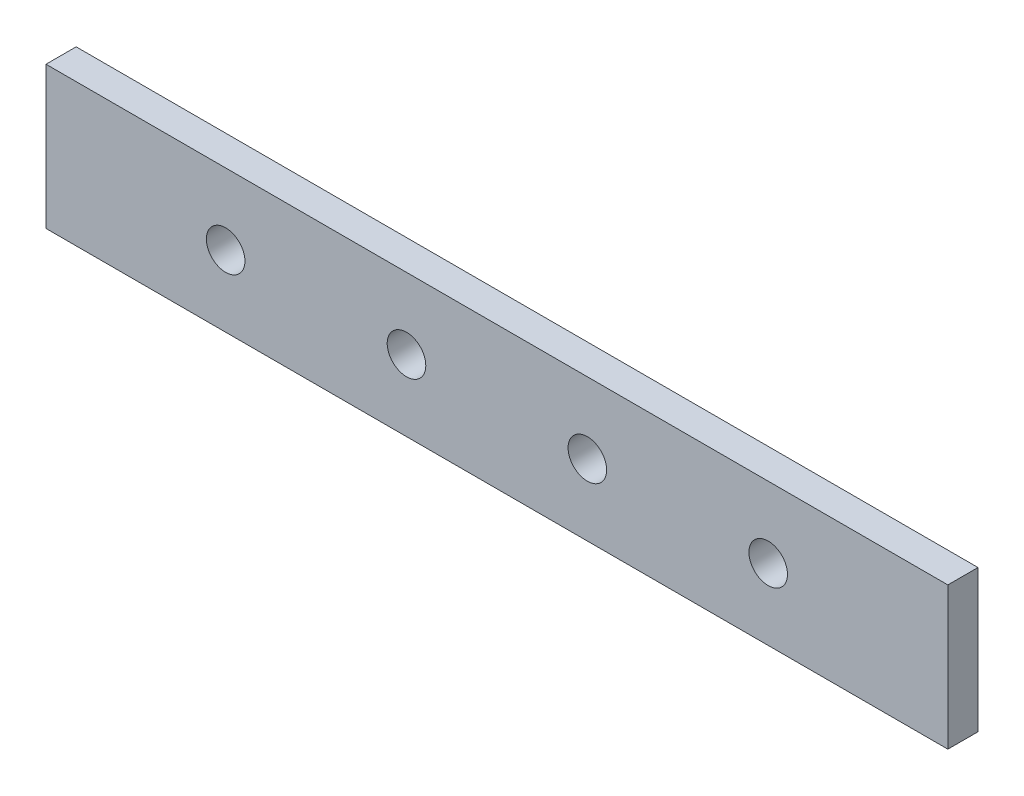
ISO-10303-21;
HEADER;
FILE_DESCRIPTION(('STEP AP214'),'2;1');
FILE_NAME('part.step','',(''),(''),'','','');
FILE_SCHEMA(('AUTOMOTIVE_DESIGN { 1 0 10303 214 1 1 1 1 }'));
ENDSEC;
DATA;
#1=APPLICATION_CONTEXT('core data for automotive mechanical design processes');
#2=APPLICATION_PROTOCOL_DEFINITION('international standard','automotive_design',2000,#1);
#3=PRODUCT_CONTEXT('',#1,'mechanical');
#4=PRODUCT('Part','Part','',(#3));
#5=PRODUCT_RELATED_PRODUCT_CATEGORY('part','',(#4));
#6=PRODUCT_DEFINITION_FORMATION('','',#4);
#7=PRODUCT_DEFINITION_CONTEXT('part definition',#1,'design');
#8=PRODUCT_DEFINITION('design','',#6,#7);
#9=PRODUCT_DEFINITION_SHAPE('','',#8);
#10=(LENGTH_UNIT() NAMED_UNIT(*) SI_UNIT(.MILLI.,.METRE.));
#11=(NAMED_UNIT(*) PLANE_ANGLE_UNIT() SI_UNIT($,.RADIAN.));
#12=(NAMED_UNIT(*) SI_UNIT($,.STERADIAN.) SOLID_ANGLE_UNIT());
#13=UNCERTAINTY_MEASURE_WITH_UNIT(LENGTH_MEASURE(1.E-05),#10,'distance_accuracy_value','');
#14=(GEOMETRIC_REPRESENTATION_CONTEXT(3) GLOBAL_UNCERTAINTY_ASSIGNED_CONTEXT((#13)) GLOBAL_UNIT_ASSIGNED_CONTEXT((#10,
#11,#12)) REPRESENTATION_CONTEXT('',''));
#15=CARTESIAN_POINT('',(0.,0.,0.));
#16=DIRECTION('',(0.,0.,1.));
#17=DIRECTION('',(1.,0.,0.));
#18=AXIS2_PLACEMENT_3D('',#15,#16,#17);
#19=CARTESIAN_POINT('',(-37.4,0.,2.5));
#20=DIRECTION('',(1.,0.,0.));
#21=DIRECTION('',(0.,0.,-1.));
#22=AXIS2_PLACEMENT_3D('',#19,#20,#21);
#23=PLANE('',#22);
#24=DIRECTION('',(0.,-1.,0.));
#25=VECTOR('',#24,1.);
#26=CARTESIAN_POINT('',(-37.4,0.,0.));
#27=LINE('',#26,#25);
#28=CARTESIAN_POINT('',(-37.4,-70.1,0.));
#29=VERTEX_POINT('',#28);
#30=CARTESIAN_POINT('',(-37.4,-81.9,0.));
#31=VERTEX_POINT('',#30);
#32=EDGE_CURVE('E102',#29,#31,#27,.T.);
#33=ORIENTED_EDGE('',*,*,#32,.T.);
#34=DIRECTION('',(0.,0.,-1.));
#35=VECTOR('',#34,1.);
#36=CARTESIAN_POINT('',(-37.4,-81.9,2.5));
#37=LINE('',#36,#35);
#38=CARTESIAN_POINT('',(-37.4,-81.9,2.5));
#39=VERTEX_POINT('',#38);
#40=EDGE_CURVE('E11',#39,#31,#37,.T.);
#41=ORIENTED_EDGE('',*,*,#40,.F.);
#42=DIRECTION('',(0.,-1.,0.));
#43=VECTOR('',#42,1.);
#44=CARTESIAN_POINT('',(-37.4,0.,2.5));
#45=LINE('',#44,#43);
#46=CARTESIAN_POINT('',(-37.4,-70.1,2.5));
#47=VERTEX_POINT('',#46);
#48=EDGE_CURVE('E90',#47,#39,#45,.T.);
#49=ORIENTED_EDGE('',*,*,#48,.F.);
#50=DIRECTION('',(0.,0.,-1.));
#51=VECTOR('',#50,1.);
#52=CARTESIAN_POINT('',(-37.4,-70.1,2.5));
#53=LINE('',#52,#51);
#54=EDGE_CURVE('E98',#47,#29,#53,.T.);
#55=ORIENTED_EDGE('',*,*,#54,.T.);
#56=EDGE_LOOP('',(#33,#41,#49,#55));
#57=FACE_BOUND('',#56,.T.);
#58=ADVANCED_FACE('F39',(#57),#23,.F.);
#59=CARTESIAN_POINT('',(0.,-81.9,2.5));
#60=DIRECTION('',(0.,1.,0.));
#61=DIRECTION('',(0.,0.,1.));
#62=AXIS2_PLACEMENT_3D('',#59,#60,#61);
#63=PLANE('',#62);
#64=DIRECTION('',(1.,0.,0.));
#65=VECTOR('',#64,1.);
#66=CARTESIAN_POINT('',(0.,-81.9,0.));
#67=LINE('',#66,#65);
#68=CARTESIAN_POINT('',(37.4,-81.9,0.));
#69=VERTEX_POINT('',#68);
#70=EDGE_CURVE('E94',#31,#69,#67,.T.);
#71=ORIENTED_EDGE('',*,*,#70,.T.);
#72=DIRECTION('',(0.,0.,-1.));
#73=VECTOR('',#72,1.);
#74=CARTESIAN_POINT('',(37.4,-81.9,2.5));
#75=LINE('',#74,#73);
#76=CARTESIAN_POINT('',(37.4,-81.9,2.5));
#77=VERTEX_POINT('',#76);
#78=EDGE_CURVE('E47',#77,#69,#75,.T.);
#79=ORIENTED_EDGE('',*,*,#78,.F.);
#80=DIRECTION('',(1.,0.,0.));
#81=VECTOR('',#80,1.);
#82=CARTESIAN_POINT('',(0.,-81.9,2.5));
#83=LINE('',#82,#81);
#84=EDGE_CURVE('E85',#39,#77,#83,.T.);
#85=ORIENTED_EDGE('',*,*,#84,.F.);
#86=ORIENTED_EDGE('',*,*,#40,.T.);
#87=EDGE_LOOP('',(#71,#79,#85,#86));
#88=FACE_BOUND('',#87,.T.);
#89=ADVANCED_FACE('F93',(#88),#63,.F.);
#90=CARTESIAN_POINT('',(37.4,0.,2.5));
#91=DIRECTION('',(-1.,0.,0.));
#92=DIRECTION('',(0.,0.,1.));
#93=AXIS2_PLACEMENT_3D('',#90,#91,#92);
#94=PLANE('',#93);
#95=DIRECTION('',(0.,1.,0.));
#96=VECTOR('',#95,1.);
#97=CARTESIAN_POINT('',(37.4,0.,0.));
#98=LINE('',#97,#96);
#99=CARTESIAN_POINT('',(37.4,-70.1,0.));
#100=VERTEX_POINT('',#99);
#101=EDGE_CURVE('E72',#69,#100,#98,.T.);
#102=ORIENTED_EDGE('',*,*,#101,.T.);
#103=DIRECTION('',(0.,0.,-1.));
#104=VECTOR('',#103,1.);
#105=CARTESIAN_POINT('',(37.4,-70.1,2.5));
#106=LINE('',#105,#104);
#107=CARTESIAN_POINT('',(37.4,-70.1,2.5));
#108=VERTEX_POINT('',#107);
#109=EDGE_CURVE('E95',#108,#100,#106,.T.);
#110=ORIENTED_EDGE('',*,*,#109,.F.);
#111=DIRECTION('',(0.,1.,0.));
#112=VECTOR('',#111,1.);
#113=CARTESIAN_POINT('',(37.4,0.,2.5));
#114=LINE('',#113,#112);
#115=EDGE_CURVE('E88',#77,#108,#114,.T.);
#116=ORIENTED_EDGE('',*,*,#115,.F.);
#117=ORIENTED_EDGE('',*,*,#78,.T.);
#118=EDGE_LOOP('',(#102,#110,#116,#117));
#119=FACE_BOUND('',#118,.T.);
#120=ADVANCED_FACE('F96',(#119),#94,.F.);
#121=CARTESIAN_POINT('',(0.,-70.1,2.5));
#122=DIRECTION('',(0.,-1.,0.));
#123=DIRECTION('',(1.,0.,0.));
#124=AXIS2_PLACEMENT_3D('',#121,#122,#123);
#125=PLANE('',#124);
#126=DIRECTION('',(-1.,0.,0.));
#127=VECTOR('',#126,1.);
#128=CARTESIAN_POINT('',(0.,-70.1,0.));
#129=LINE('',#128,#127);
#130=EDGE_CURVE('E78',#100,#29,#129,.T.);
#131=ORIENTED_EDGE('',*,*,#130,.T.);
#132=ORIENTED_EDGE('',*,*,#54,.F.);
#133=DIRECTION('',(-1.,0.,0.));
#134=VECTOR('',#133,1.);
#135=CARTESIAN_POINT('',(0.,-70.1,2.5));
#136=LINE('',#135,#134);
#137=EDGE_CURVE('E55',#108,#47,#136,.T.);
#138=ORIENTED_EDGE('',*,*,#137,.F.);
#139=ORIENTED_EDGE('',*,*,#109,.T.);
#140=EDGE_LOOP('',(#131,#132,#138,#139));
#141=FACE_BOUND('',#140,.T.);
#142=ADVANCED_FACE('F110',(#141),#125,.F.);
#143=CARTESIAN_POINT('',(0.,0.,2.5));
#144=DIRECTION('',(0.,0.,1.));
#145=DIRECTION('',(1.,0.,0.));
#146=AXIS2_PLACEMENT_3D('',#143,#144,#145);
#147=PLANE('',#146);
#148=CARTESIAN_POINT('',(-22.5,-76.,2.5));
#149=DIRECTION('',(0.,0.,1.));
#150=DIRECTION('',(1.,0.,0.));
#151=AXIS2_PLACEMENT_3D('',#148,#149,#150);
#152=CIRCLE('',#151,1.60000000000002);
#153=CARTESIAN_POINT('',(-20.9,-76.,2.5));
#154=VERTEX_POINT('',#153);
#155=EDGE_CURVE('E127',#154,#154,#152,.T.);
#156=ORIENTED_EDGE('',*,*,#155,.F.);
#157=EDGE_LOOP('',(#156));
#158=FACE_BOUND('',#157,.T.);
#159=CARTESIAN_POINT('',(7.50000000000001,-76.,2.5));
#160=DIRECTION('',(0.,0.,1.));
#161=DIRECTION('',(1.,0.,0.));
#162=AXIS2_PLACEMENT_3D('',#159,#160,#161);
#163=CIRCLE('',#162,1.6);
#164=CARTESIAN_POINT('',(9.10000000000002,-76.,2.5));
#165=VERTEX_POINT('',#164);
#166=EDGE_CURVE('E132',#165,#165,#163,.T.);
#167=ORIENTED_EDGE('',*,*,#166,.F.);
#168=EDGE_LOOP('',(#167));
#169=FACE_BOUND('',#168,.T.);
#170=CARTESIAN_POINT('',(-7.49999999999999,-76.,2.5));
#171=DIRECTION('',(0.,0.,1.));
#172=DIRECTION('',(1.,0.,0.));
#173=AXIS2_PLACEMENT_3D('',#170,#171,#172);
#174=CIRCLE('',#173,1.60000000000001);
#175=CARTESIAN_POINT('',(-5.89999999999998,-76.,2.5));
#176=VERTEX_POINT('',#175);
#177=EDGE_CURVE('E120',#176,#176,#174,.T.);
#178=ORIENTED_EDGE('',*,*,#177,.F.);
#179=EDGE_LOOP('',(#178));
#180=FACE_BOUND('',#179,.T.);
#181=CARTESIAN_POINT('',(22.5,-76.,2.5));
#182=DIRECTION('',(0.,0.,1.));
#183=DIRECTION('',(1.,0.,0.));
#184=AXIS2_PLACEMENT_3D('',#181,#182,#183);
#185=CIRCLE('',#184,1.60000000000002);
#186=CARTESIAN_POINT('',(24.1,-76.,2.5));
#187=VERTEX_POINT('',#186);
#188=EDGE_CURVE('E119',#187,#187,#185,.T.);
#189=ORIENTED_EDGE('',*,*,#188,.F.);
#190=EDGE_LOOP('',(#189));
#191=FACE_BOUND('',#190,.T.);
#192=ORIENTED_EDGE('',*,*,#48,.T.);
#193=ORIENTED_EDGE('',*,*,#84,.T.);
#194=ORIENTED_EDGE('',*,*,#115,.T.);
#195=ORIENTED_EDGE('',*,*,#137,.T.);
#196=EDGE_LOOP('',(#192,#193,#194,#195));
#197=FACE_BOUND('',#196,.T.);
#198=ADVANCED_FACE('F86',(#158,#169,#180,#191,#197),#147,.T.);
#199=CARTESIAN_POINT('',(0.,0.,0.));
#200=DIRECTION('',(0.,0.,1.));
#201=DIRECTION('',(1.,0.,0.));
#202=AXIS2_PLACEMENT_3D('',#199,#200,#201);
#203=PLANE('',#202);
#204=CARTESIAN_POINT('',(-22.5,-76.,0.));
#205=DIRECTION('',(0.,0.,1.));
#206=DIRECTION('',(1.,0.,0.));
#207=AXIS2_PLACEMENT_3D('',#204,#205,#206);
#208=CIRCLE('',#207,1.60000000000002);
#209=CARTESIAN_POINT('',(-20.9,-76.,0.));
#210=VERTEX_POINT('',#209);
#211=EDGE_CURVE('E105',#210,#210,#208,.F.);
#212=ORIENTED_EDGE('',*,*,#211,.F.);
#213=EDGE_LOOP('',(#212));
#214=FACE_BOUND('',#213,.T.);
#215=CARTESIAN_POINT('',(7.50000000000001,-76.,0.));
#216=DIRECTION('',(0.,0.,1.));
#217=DIRECTION('',(1.,0.,0.));
#218=AXIS2_PLACEMENT_3D('',#215,#216,#217);
#219=CIRCLE('',#218,1.6);
#220=CARTESIAN_POINT('',(9.10000000000002,-76.,0.));
#221=VERTEX_POINT('',#220);
#222=EDGE_CURVE('E123',#221,#221,#219,.F.);
#223=ORIENTED_EDGE('',*,*,#222,.F.);
#224=EDGE_LOOP('',(#223));
#225=FACE_BOUND('',#224,.T.);
#226=CARTESIAN_POINT('',(-7.49999999999999,-76.,0.));
#227=DIRECTION('',(0.,0.,1.));
#228=DIRECTION('',(1.,0.,0.));
#229=AXIS2_PLACEMENT_3D('',#226,#227,#228);
#230=CIRCLE('',#229,1.60000000000001);
#231=CARTESIAN_POINT('',(-5.89999999999998,-76.,0.));
#232=VERTEX_POINT('',#231);
#233=EDGE_CURVE('E116',#232,#232,#230,.F.);
#234=ORIENTED_EDGE('',*,*,#233,.F.);
#235=EDGE_LOOP('',(#234));
#236=FACE_BOUND('',#235,.T.);
#237=CARTESIAN_POINT('',(22.5,-76.,0.));
#238=DIRECTION('',(0.,0.,1.));
#239=DIRECTION('',(1.,0.,0.));
#240=AXIS2_PLACEMENT_3D('',#237,#238,#239);
#241=CIRCLE('',#240,1.60000000000002);
#242=CARTESIAN_POINT('',(24.1,-76.,0.));
#243=VERTEX_POINT('',#242);
#244=EDGE_CURVE('E124',#243,#243,#241,.F.);
#245=ORIENTED_EDGE('',*,*,#244,.F.);
#246=EDGE_LOOP('',(#245));
#247=FACE_BOUND('',#246,.T.);
#248=ORIENTED_EDGE('',*,*,#32,.F.);
#249=ORIENTED_EDGE('',*,*,#130,.F.);
#250=ORIENTED_EDGE('',*,*,#101,.F.);
#251=ORIENTED_EDGE('',*,*,#70,.F.);
#252=EDGE_LOOP('',(#248,#249,#250,#251));
#253=FACE_BOUND('',#252,.T.);
#254=ADVANCED_FACE('F113',(#214,#225,#236,#247,#253),#203,.F.);
#255=CARTESIAN_POINT('',(22.5,-76.,-0.00100000000000013));
#256=DIRECTION('',(0.,0.,1.));
#257=DIRECTION('',(1.,0.,0.));
#258=AXIS2_PLACEMENT_3D('',#255,#256,#257);
#259=CYLINDRICAL_SURFACE('',#258,1.60000000000002);
#260=ORIENTED_EDGE('',*,*,#188,.T.);
#261=EDGE_LOOP('',(#260));
#262=FACE_BOUND('',#261,.T.);
#263=ORIENTED_EDGE('',*,*,#244,.T.);
#264=EDGE_LOOP('',(#263));
#265=FACE_BOUND('',#264,.T.);
#266=ADVANCED_FACE('F152',(#262,#265),#259,.F.);
#267=CARTESIAN_POINT('',(-7.49999999999999,-76.,-0.00100000000000013));
#268=DIRECTION('',(0.,0.,1.));
#269=DIRECTION('',(1.,0.,0.));
#270=AXIS2_PLACEMENT_3D('',#267,#268,#269);
#271=CYLINDRICAL_SURFACE('',#270,1.60000000000001);
#272=ORIENTED_EDGE('',*,*,#177,.T.);
#273=EDGE_LOOP('',(#272));
#274=FACE_BOUND('',#273,.T.);
#275=ORIENTED_EDGE('',*,*,#233,.T.);
#276=EDGE_LOOP('',(#275));
#277=FACE_BOUND('',#276,.T.);
#278=ADVANCED_FACE('F155',(#274,#277),#271,.F.);
#279=CARTESIAN_POINT('',(7.50000000000001,-76.,-0.00100000000000013));
#280=DIRECTION('',(0.,0.,1.));
#281=DIRECTION('',(1.,0.,0.));
#282=AXIS2_PLACEMENT_3D('',#279,#280,#281);
#283=CYLINDRICAL_SURFACE('',#282,1.6);
#284=ORIENTED_EDGE('',*,*,#166,.T.);
#285=EDGE_LOOP('',(#284));
#286=FACE_BOUND('',#285,.T.);
#287=ORIENTED_EDGE('',*,*,#222,.T.);
#288=EDGE_LOOP('',(#287));
#289=FACE_BOUND('',#288,.T.);
#290=ADVANCED_FACE('F203',(#286,#289),#283,.F.);
#291=CARTESIAN_POINT('',(-22.5,-76.,-0.00100000000000013));
#292=DIRECTION('',(0.,0.,1.));
#293=DIRECTION('',(1.,0.,0.));
#294=AXIS2_PLACEMENT_3D('',#291,#292,#293);
#295=CYLINDRICAL_SURFACE('',#294,1.60000000000002);
#296=ORIENTED_EDGE('',*,*,#155,.T.);
#297=EDGE_LOOP('',(#296));
#298=FACE_BOUND('',#297,.T.);
#299=ORIENTED_EDGE('',*,*,#211,.T.);
#300=EDGE_LOOP('',(#299));
#301=FACE_BOUND('',#300,.T.);
#302=ADVANCED_FACE('F140',(#298,#301),#295,.F.);
#303=CLOSED_SHELL('',(#58,#89,#120,#142,#198,#254,#266,#278,#290,#302));
#304=MANIFOLD_SOLID_BREP('B2',#303);
#305=ADVANCED_BREP_SHAPE_REPRESENTATION('',(#18,#304),#14);
#306=SHAPE_DEFINITION_REPRESENTATION(#9,#305);
ENDSEC;
END-ISO-10303-21;
